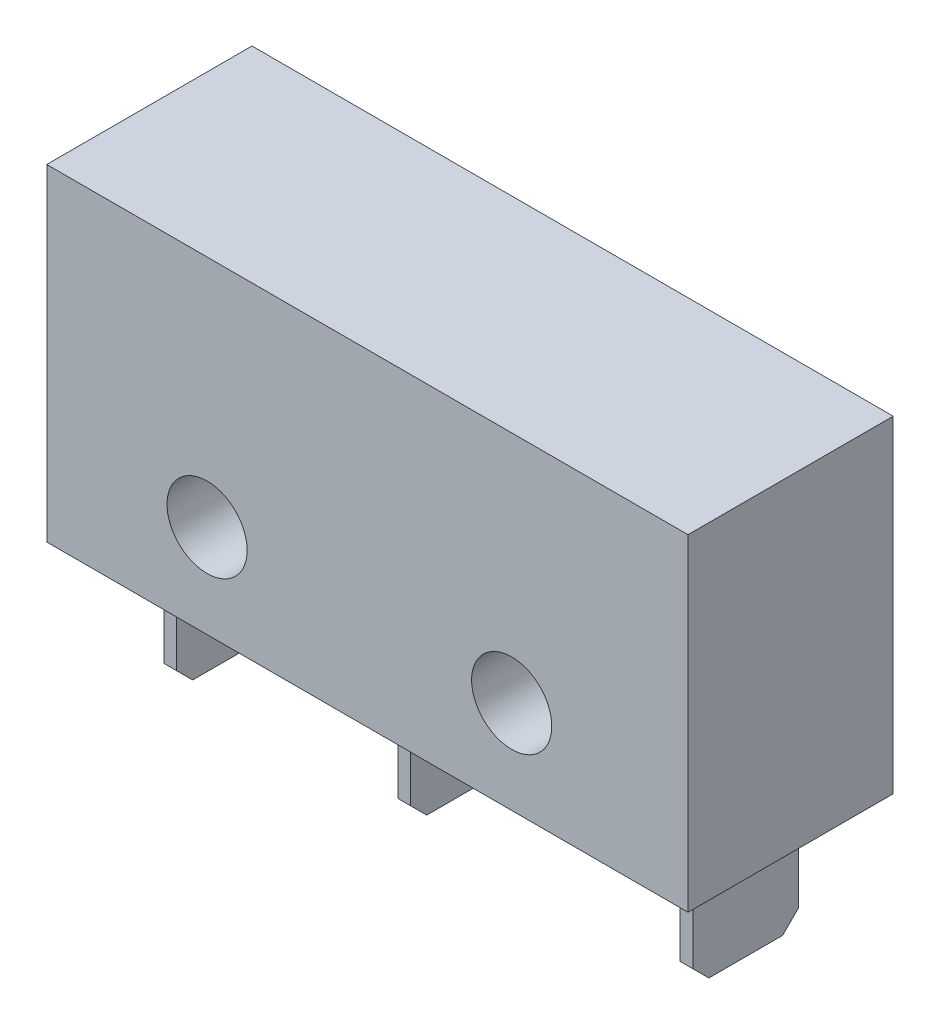
ISO-10303-21;
HEADER;
FILE_DESCRIPTION(('STEP AP214'),'2;1');
FILE_NAME('part.step','',(''),(''),'','','');
FILE_SCHEMA(('AUTOMOTIVE_DESIGN { 1 0 10303 214 1 1 1 1 }'));
ENDSEC;
DATA;
#1=APPLICATION_CONTEXT('core data for automotive mechanical design processes');
#2=APPLICATION_PROTOCOL_DEFINITION('international standard','automotive_design',2000,#1);
#3=PRODUCT_CONTEXT('',#1,'mechanical');
#4=PRODUCT('Part','Part','',(#3));
#5=PRODUCT_RELATED_PRODUCT_CATEGORY('part','',(#4));
#6=PRODUCT_DEFINITION_FORMATION('','',#4);
#7=PRODUCT_DEFINITION_CONTEXT('part definition',#1,'design');
#8=PRODUCT_DEFINITION('design','',#6,#7);
#9=PRODUCT_DEFINITION_SHAPE('','',#8);
#10=(LENGTH_UNIT() NAMED_UNIT(*) SI_UNIT(.MILLI.,.METRE.));
#11=(NAMED_UNIT(*) PLANE_ANGLE_UNIT() SI_UNIT($,.RADIAN.));
#12=(NAMED_UNIT(*) SI_UNIT($,.STERADIAN.) SOLID_ANGLE_UNIT());
#13=UNCERTAINTY_MEASURE_WITH_UNIT(LENGTH_MEASURE(1.E-05),#10,'distance_accuracy_value','');
#14=(GEOMETRIC_REPRESENTATION_CONTEXT(3) GLOBAL_UNCERTAINTY_ASSIGNED_CONTEXT((#13)) GLOBAL_UNIT_ASSIGNED_CONTEXT((#10,
#11,#12)) REPRESENTATION_CONTEXT('',''));
#15=CARTESIAN_POINT('',(0.,0.,0.));
#16=DIRECTION('',(0.,0.,1.));
#17=DIRECTION('',(1.,0.,0.));
#18=AXIS2_PLACEMENT_3D('',#15,#16,#17);
#19=CARTESIAN_POINT('',(0.,0.,6.4));
#20=DIRECTION('',(0.,0.999999999999998,0.));
#21=DIRECTION('',(0.,0.,0.999999999999996));
#22=AXIS2_PLACEMENT_3D('',#19,#20,#21);
#23=PLANE('',#22);
#24=DIRECTION('',(0.,0.,-0.999999999999996));
#25=VECTOR('',#24,1.);
#26=CARTESIAN_POINT('',(9.4,0.,4.85));
#27=LINE('',#26,#25);
#28=CARTESIAN_POINT('',(9.4,0.,4.85));
#29=VERTEX_POINT('',#28);
#30=CARTESIAN_POINT('',(9.4,0.,1.55));
#31=VERTEX_POINT('',#30);
#32=EDGE_CURVE('E218',#29,#31,#27,.T.);
#33=ORIENTED_EDGE('',*,*,#32,.F.);
#34=DIRECTION('',(-0.999999999999998,0.,0.));
#35=VECTOR('',#34,1.);
#36=CARTESIAN_POINT('',(9.4,0.,4.85));
#37=LINE('',#36,#35);
#38=CARTESIAN_POINT('',(9.8,-1.2490009027033E-13,4.85));
#39=VERTEX_POINT('',#38);
#40=EDGE_CURVE('E223',#39,#29,#37,.T.);
#41=ORIENTED_EDGE('',*,*,#40,.F.);
#42=DIRECTION('',(0.,0.,0.999999999999996));
#43=VECTOR('',#42,1.);
#44=CARTESIAN_POINT('',(9.8,-1.2490009027033E-13,4.85));
#45=LINE('',#44,#43);
#46=CARTESIAN_POINT('',(9.8,-1.2490009027033E-13,1.55));
#47=VERTEX_POINT('',#46);
#48=EDGE_CURVE('E232',#47,#39,#45,.T.);
#49=ORIENTED_EDGE('',*,*,#48,.F.);
#50=DIRECTION('',(0.999999999999998,0.,0.));
#51=VECTOR('',#50,1.);
#52=CARTESIAN_POINT('',(9.4,0.,1.55));
#53=LINE('',#52,#51);
#54=EDGE_CURVE('E229',#31,#47,#53,.T.);
#55=ORIENTED_EDGE('',*,*,#54,.F.);
#56=EDGE_LOOP('',(#33,#41,#49,#55));
#57=FACE_BOUND('',#56,.T.);
#58=DIRECTION('',(0.999999999999998,0.,0.));
#59=VECTOR('',#58,1.);
#60=CARTESIAN_POINT('',(0.,0.,0.));
#61=LINE('',#60,#59);
#62=CARTESIAN_POINT('',(0.,0.,0.));
#63=VERTEX_POINT('',#62);
#64=CARTESIAN_POINT('',(19.9999999999999,1.2490009027033E-13,0.));
#65=VERTEX_POINT('',#64);
#66=EDGE_CURVE('E284',#63,#65,#61,.T.);
#67=ORIENTED_EDGE('',*,*,#66,.T.);
#68=DIRECTION('',(0.,0.,-0.999999999999996));
#69=VECTOR('',#68,1.);
#70=CARTESIAN_POINT('',(19.9999999999999,1.2490009027033E-13,6.4));
#71=LINE('',#70,#69);
#72=CARTESIAN_POINT('',(19.9999999999999,1.2490009027033E-13,6.4));
#73=VERTEX_POINT('',#72);
#74=EDGE_CURVE('E294',#73,#65,#71,.T.);
#75=ORIENTED_EDGE('',*,*,#74,.F.);
#76=DIRECTION('',(0.999999999999998,0.,0.));
#77=VECTOR('',#76,1.);
#78=CARTESIAN_POINT('',(0.,0.,6.4));
#79=LINE('',#78,#77);
#80=CARTESIAN_POINT('',(0.,0.,6.4));
#81=VERTEX_POINT('',#80);
#82=EDGE_CURVE('E274',#81,#73,#79,.T.);
#83=ORIENTED_EDGE('',*,*,#82,.F.);
#84=DIRECTION('',(0.,0.,-0.999999999999996));
#85=VECTOR('',#84,1.);
#86=CARTESIAN_POINT('',(0.,0.,6.4));
#87=LINE('',#86,#85);
#88=EDGE_CURVE('E297',#81,#63,#87,.T.);
#89=ORIENTED_EDGE('',*,*,#88,.T.);
#90=EDGE_LOOP('',(#67,#75,#83,#89));
#91=FACE_BOUND('',#90,.T.);
#92=DIRECTION('',(0.,0.,-0.999999999999996));
#93=VECTOR('',#92,1.);
#94=CARTESIAN_POINT('',(18.1999999999999,3.7470027081099E-13,4.85));
#95=LINE('',#94,#93);
#96=CARTESIAN_POINT('',(18.1999999999999,3.7470027081099E-13,4.85));
#97=VERTEX_POINT('',#96);
#98=CARTESIAN_POINT('',(18.1999999999999,3.7470027081099E-13,1.55));
#99=VERTEX_POINT('',#98);
#100=EDGE_CURVE('E244',#97,#99,#95,.T.);
#101=ORIENTED_EDGE('',*,*,#100,.F.);
#102=DIRECTION('',(-0.999999999999998,0.,0.));
#103=VECTOR('',#102,1.);
#104=CARTESIAN_POINT('',(18.1999999999999,3.7470027081099E-13,4.85));
#105=LINE('',#104,#103);
#106=CARTESIAN_POINT('',(18.5999999999999,1.2490009027033E-13,4.84999999999999));
#107=VERTEX_POINT('',#106);
#108=EDGE_CURVE('E249',#107,#97,#105,.T.);
#109=ORIENTED_EDGE('',*,*,#108,.F.);
#110=DIRECTION('',(0.,0.,0.999999999999996));
#111=VECTOR('',#110,1.);
#112=CARTESIAN_POINT('',(18.5999999999999,1.2490009027033E-13,4.84999999999999));
#113=LINE('',#112,#111);
#114=CARTESIAN_POINT('',(18.5999999999999,1.2490009027033E-13,1.55));
#115=VERTEX_POINT('',#114);
#116=EDGE_CURVE('E258',#115,#107,#113,.T.);
#117=ORIENTED_EDGE('',*,*,#116,.F.);
#118=DIRECTION('',(0.999999999999998,0.,0.));
#119=VECTOR('',#118,1.);
#120=CARTESIAN_POINT('',(18.1999999999999,3.7470027081099E-13,1.55));
#121=LINE('',#120,#119);
#122=EDGE_CURVE('E255',#99,#115,#121,.T.);
#123=ORIENTED_EDGE('',*,*,#122,.F.);
#124=EDGE_LOOP('',(#101,#109,#117,#123));
#125=FACE_BOUND('',#124,.T.);
#126=DIRECTION('',(0.,0.,-0.999999999999996));
#127=VECTOR('',#126,1.);
#128=CARTESIAN_POINT('',(2.1,0.,4.85));
#129=LINE('',#128,#127);
#130=CARTESIAN_POINT('',(2.1,0.,4.85));
#131=VERTEX_POINT('',#130);
#132=CARTESIAN_POINT('',(2.1,0.,1.55));
#133=VERTEX_POINT('',#132);
#134=EDGE_CURVE('E186',#131,#133,#129,.T.);
#135=ORIENTED_EDGE('',*,*,#134,.F.);
#136=DIRECTION('',(-0.999999999999998,0.,0.));
#137=VECTOR('',#136,1.);
#138=CARTESIAN_POINT('',(2.1,0.,4.85));
#139=LINE('',#138,#137);
#140=CARTESIAN_POINT('',(2.5,0.,4.85));
#141=VERTEX_POINT('',#140);
#142=EDGE_CURVE('E197',#141,#131,#139,.T.);
#143=ORIENTED_EDGE('',*,*,#142,.F.);
#144=DIRECTION('',(0.,0.,0.999999999999996));
#145=VECTOR('',#144,1.);
#146=CARTESIAN_POINT('',(2.5,0.,4.85));
#147=LINE('',#146,#145);
#148=CARTESIAN_POINT('',(2.5,0.,1.55));
#149=VERTEX_POINT('',#148);
#150=EDGE_CURVE('E206',#149,#141,#147,.T.);
#151=ORIENTED_EDGE('',*,*,#150,.F.);
#152=DIRECTION('',(0.999999999999998,0.,0.));
#153=VECTOR('',#152,1.);
#154=CARTESIAN_POINT('',(2.1,0.,1.55));
#155=LINE('',#154,#153);
#156=EDGE_CURVE('E200',#133,#149,#155,.T.);
#157=ORIENTED_EDGE('',*,*,#156,.F.);
#158=EDGE_LOOP('',(#135,#143,#151,#157));
#159=FACE_BOUND('',#158,.T.);
#160=ADVANCED_FACE('F36',(#57,#91,#125,#159),#23,.F.);
#161=CARTESIAN_POINT('',(0.,0.,6.4));
#162=DIRECTION('',(0.999999999999998,0.,0.));
#163=DIRECTION('',(0.,0.,-0.999999999999996));
#164=AXIS2_PLACEMENT_3D('',#161,#162,#163);
#165=PLANE('',#164);
#166=DIRECTION('',(0.,-0.999999999999998,0.));
#167=VECTOR('',#166,1.);
#168=CARTESIAN_POINT('',(0.,0.,0.));
#169=LINE('',#168,#167);
#170=CARTESIAN_POINT('',(0.,10.2,0.));
#171=VERTEX_POINT('',#170);
#172=EDGE_CURVE('E270',#171,#63,#169,.T.);
#173=ORIENTED_EDGE('',*,*,#172,.T.);
#174=ORIENTED_EDGE('',*,*,#88,.F.);
#175=DIRECTION('',(0.,-0.999999999999998,0.));
#176=VECTOR('',#175,1.);
#177=CARTESIAN_POINT('',(0.,0.,6.4));
#178=LINE('',#177,#176);
#179=CARTESIAN_POINT('',(0.,10.2,6.4));
#180=VERTEX_POINT('',#179);
#181=EDGE_CURVE('E271',#180,#81,#178,.T.);
#182=ORIENTED_EDGE('',*,*,#181,.F.);
#183=DIRECTION('',(0.,0.,-0.999999999999996));
#184=VECTOR('',#183,1.);
#185=CARTESIAN_POINT('',(0.,10.2,6.4));
#186=LINE('',#185,#184);
#187=EDGE_CURVE('E281',#180,#171,#186,.T.);
#188=ORIENTED_EDGE('',*,*,#187,.T.);
#189=EDGE_LOOP('',(#173,#174,#182,#188));
#190=FACE_BOUND('',#189,.T.);
#191=ADVANCED_FACE('F389',(#190),#165,.F.);
#192=CARTESIAN_POINT('',(19.9999999999999,1.2490009027033E-13,6.4));
#193=DIRECTION('',(-0.999999999999998,0.,0.));
#194=DIRECTION('',(0.,0.,0.999999999999996));
#195=AXIS2_PLACEMENT_3D('',#192,#193,#194);
#196=PLANE('',#195);
#197=DIRECTION('',(0.,0.999999999999998,0.));
#198=VECTOR('',#197,1.);
#199=CARTESIAN_POINT('',(19.9999999999999,1.2490009027033E-13,0.));
#200=LINE('',#199,#198);
#201=CARTESIAN_POINT('',(19.9999999999999,10.2,0.));
#202=VERTEX_POINT('',#201);
#203=EDGE_CURVE('E286',#65,#202,#200,.T.);
#204=ORIENTED_EDGE('',*,*,#203,.T.);
#205=DIRECTION('',(0.,0.,-0.999999999999996));
#206=VECTOR('',#205,1.);
#207=CARTESIAN_POINT('',(19.9999999999999,10.2,6.4));
#208=LINE('',#207,#206);
#209=CARTESIAN_POINT('',(19.9999999999999,10.2,6.4));
#210=VERTEX_POINT('',#209);
#211=EDGE_CURVE('E291',#210,#202,#208,.T.);
#212=ORIENTED_EDGE('',*,*,#211,.F.);
#213=DIRECTION('',(0.,0.999999999999998,0.));
#214=VECTOR('',#213,1.);
#215=CARTESIAN_POINT('',(19.9999999999999,1.2490009027033E-13,6.4));
#216=LINE('',#215,#214);
#217=EDGE_CURVE('E277',#73,#210,#216,.T.);
#218=ORIENTED_EDGE('',*,*,#217,.F.);
#219=ORIENTED_EDGE('',*,*,#74,.T.);
#220=EDGE_LOOP('',(#204,#212,#218,#219));
#221=FACE_BOUND('',#220,.T.);
#222=ADVANCED_FACE('F397',(#221),#196,.F.);
#223=CARTESIAN_POINT('',(0.,10.2,6.4));
#224=DIRECTION('',(0.,-0.999999999999998,0.));
#225=DIRECTION('',(0.,0.,-0.999999999999996));
#226=AXIS2_PLACEMENT_3D('',#223,#224,#225);
#227=PLANE('',#226);
#228=DIRECTION('',(-0.999999999999998,0.,0.));
#229=VECTOR('',#228,1.);
#230=CARTESIAN_POINT('',(0.,10.2,0.));
#231=LINE('',#230,#229);
#232=EDGE_CURVE('E275',#202,#171,#231,.T.);
#233=ORIENTED_EDGE('',*,*,#232,.T.);
#234=ORIENTED_EDGE('',*,*,#187,.F.);
#235=DIRECTION('',(-0.999999999999998,0.,0.));
#236=VECTOR('',#235,1.);
#237=CARTESIAN_POINT('',(0.,10.2,6.4));
#238=LINE('',#237,#236);
#239=EDGE_CURVE('E279',#210,#180,#238,.T.);
#240=ORIENTED_EDGE('',*,*,#239,.F.);
#241=ORIENTED_EDGE('',*,*,#211,.T.);
#242=EDGE_LOOP('',(#233,#234,#240,#241));
#243=FACE_BOUND('',#242,.T.);
#244=ADVANCED_FACE('F379',(#243),#227,.F.);
#245=CARTESIAN_POINT('',(0.,0.,6.4));
#246=DIRECTION('',(0.,0.,-0.999999999999996));
#247=DIRECTION('',(-0.999999999999998,0.,0.));
#248=AXIS2_PLACEMENT_3D('',#245,#246,#247);
#249=PLANE('',#248);
#250=CARTESIAN_POINT('',(14.5,2.90000000000011,6.4));
#251=DIRECTION('',(0.,0.,0.999999999999996));
#252=DIRECTION('',(0.999999999999998,0.,0.));
#253=AXIS2_PLACEMENT_3D('',#250,#251,#252);
#254=CIRCLE('',#253,1.25);
#255=CARTESIAN_POINT('',(15.75,2.90000000000011,6.4));
#256=VERTEX_POINT('',#255);
#257=EDGE_CURVE('E201',#256,#256,#254,.T.);
#258=ORIENTED_EDGE('',*,*,#257,.F.);
#259=EDGE_LOOP('',(#258));
#260=FACE_BOUND('',#259,.T.);
#261=CARTESIAN_POINT('',(4.99999999999994,2.90000000000037,6.4));
#262=DIRECTION('',(0.,0.,0.999999999999996));
#263=DIRECTION('',(0.999999999999998,0.,0.));
#264=AXIS2_PLACEMENT_3D('',#261,#262,#263);
#265=CIRCLE('',#264,1.25);
#266=CARTESIAN_POINT('',(6.24999999999994,2.90000000000037,6.4));
#267=VERTEX_POINT('',#266);
#268=EDGE_CURVE('E364',#267,#267,#265,.T.);
#269=ORIENTED_EDGE('',*,*,#268,.F.);
#270=EDGE_LOOP('',(#269));
#271=FACE_BOUND('',#270,.T.);
#272=ORIENTED_EDGE('',*,*,#181,.T.);
#273=ORIENTED_EDGE('',*,*,#82,.T.);
#274=ORIENTED_EDGE('',*,*,#217,.T.);
#275=ORIENTED_EDGE('',*,*,#239,.T.);
#276=EDGE_LOOP('',(#272,#273,#274,#275));
#277=FACE_BOUND('',#276,.T.);
#278=ADVANCED_FACE('F375',(#260,#271,#277),#249,.F.);
#279=CARTESIAN_POINT('',(0.,0.,0.));
#280=DIRECTION('',(0.,0.,-0.999999999999996));
#281=DIRECTION('',(-0.999999999999998,0.,0.));
#282=AXIS2_PLACEMENT_3D('',#279,#280,#281);
#283=PLANE('',#282);
#284=CARTESIAN_POINT('',(14.4999999999999,2.90000000000011,0.));
#285=DIRECTION('',(0.,0.,-0.999999999999996));
#286=DIRECTION('',(-0.999999999999998,0.,0.));
#287=AXIS2_PLACEMENT_3D('',#284,#285,#286);
#288=CIRCLE('',#287,1.25);
#289=CARTESIAN_POINT('',(13.2499999999999,2.90000000000011,0.));
#290=VERTEX_POINT('',#289);
#291=EDGE_CURVE('E367',#290,#290,#288,.F.);
#292=ORIENTED_EDGE('',*,*,#291,.T.);
#293=EDGE_LOOP('',(#292));
#294=FACE_BOUND('',#293,.T.);
#295=CARTESIAN_POINT('',(4.99999999999994,2.90000000000037,0.));
#296=DIRECTION('',(0.,0.,-0.999999999999996));
#297=DIRECTION('',(-0.999999999999998,0.,0.));
#298=AXIS2_PLACEMENT_3D('',#295,#296,#297);
#299=CIRCLE('',#298,1.25);
#300=CARTESIAN_POINT('',(3.74999999999995,2.90000000000037,0.));
#301=VERTEX_POINT('',#300);
#302=EDGE_CURVE('E361',#301,#301,#299,.F.);
#303=ORIENTED_EDGE('',*,*,#302,.T.);
#304=EDGE_LOOP('',(#303));
#305=FACE_BOUND('',#304,.T.);
#306=ORIENTED_EDGE('',*,*,#172,.F.);
#307=ORIENTED_EDGE('',*,*,#232,.F.);
#308=ORIENTED_EDGE('',*,*,#203,.F.);
#309=ORIENTED_EDGE('',*,*,#66,.F.);
#310=EDGE_LOOP('',(#306,#307,#308,#309));
#311=FACE_BOUND('',#310,.T.);
#312=ADVANCED_FACE('F378',(#294,#305,#311),#283,.T.);
#313=CARTESIAN_POINT('',(18.2,-3.49999999999963,4.85));
#314=DIRECTION('',(0.999999999999998,0.,0.));
#315=DIRECTION('',(0.,0.,-0.999999999999996));
#316=AXIS2_PLACEMENT_3D('',#313,#314,#315);
#317=PLANE('',#316);
#318=DIRECTION('',(0.,0.,-0.999999999999996));
#319=VECTOR('',#318,1.);
#320=CARTESIAN_POINT('',(18.2,-3.49999999999963,4.85));
#321=LINE('',#320,#319);
#322=CARTESIAN_POINT('',(18.2,-3.49999999999963,4.35));
#323=VERTEX_POINT('',#322);
#324=CARTESIAN_POINT('',(18.2,-3.49999999999963,2.05));
#325=VERTEX_POINT('',#324);
#326=EDGE_CURVE('E245',#323,#325,#321,.T.);
#327=ORIENTED_EDGE('',*,*,#326,.F.);
#328=DIRECTION('',(0.,0.707106781186545,0.707106781186545));
#329=VECTOR('',#328,1.);
#330=CARTESIAN_POINT('',(18.2,-3.49999999999963,4.35));
#331=LINE('',#330,#329);
#332=CARTESIAN_POINT('',(18.1999999999999,-2.99999999999963,4.85));
#333=VERTEX_POINT('',#332);
#334=EDGE_CURVE('E308',#323,#333,#331,.T.);
#335=ORIENTED_EDGE('',*,*,#334,.T.);
#336=DIRECTION('',(0.,0.999999999999998,0.));
#337=VECTOR('',#336,1.);
#338=CARTESIAN_POINT('',(18.2,-3.49999999999963,4.85));
#339=LINE('',#338,#337);
#340=EDGE_CURVE('E252',#333,#97,#339,.T.);
#341=ORIENTED_EDGE('',*,*,#340,.T.);
#342=ORIENTED_EDGE('',*,*,#100,.T.);
#343=DIRECTION('',(0.,0.999999999999998,0.));
#344=VECTOR('',#343,1.);
#345=CARTESIAN_POINT('',(18.2,-3.49999999999963,1.55));
#346=LINE('',#345,#344);
#347=CARTESIAN_POINT('',(18.1999999999999,-2.99999999999963,1.55));
#348=VERTEX_POINT('',#347);
#349=EDGE_CURVE('E268',#348,#99,#346,.T.);
#350=ORIENTED_EDGE('',*,*,#349,.F.);
#351=DIRECTION('',(0.,-0.707106781186545,0.707106781186545));
#352=VECTOR('',#351,1.);
#353=CARTESIAN_POINT('',(18.2,-3.49999999999963,2.05));
#354=LINE('',#353,#352);
#355=EDGE_CURVE('E306',#348,#325,#354,.T.);
#356=ORIENTED_EDGE('',*,*,#355,.T.);
#357=EDGE_LOOP('',(#327,#335,#341,#342,#350,#356));
#358=FACE_BOUND('',#357,.T.);
#359=ADVANCED_FACE('F402',(#358),#317,.F.);
#360=CARTESIAN_POINT('',(18.2,-3.49999999999963,1.55));
#361=DIRECTION('',(0.,0.,0.999999999999996));
#362=DIRECTION('',(0.999999999999998,0.,0.));
#363=AXIS2_PLACEMENT_3D('',#360,#361,#362);
#364=PLANE('',#363);
#365=DIRECTION('',(0.,0.999999999999998,0.));
#366=VECTOR('',#365,1.);
#367=CARTESIAN_POINT('',(18.6,-3.49999999999988,1.55));
#368=LINE('',#367,#366);
#369=CARTESIAN_POINT('',(18.5999999999999,-2.99999999999988,1.55));
#370=VERTEX_POINT('',#369);
#371=EDGE_CURVE('E266',#370,#115,#368,.T.);
#372=ORIENTED_EDGE('',*,*,#371,.F.);
#373=DIRECTION('',(-0.999999999999998,0.,0.));
#374=VECTOR('',#373,1.);
#375=CARTESIAN_POINT('',(18.1999999999999,-2.99999999999963,1.55));
#376=LINE('',#375,#374);
#377=EDGE_CURVE('E316',#370,#348,#376,.T.);
#378=ORIENTED_EDGE('',*,*,#377,.T.);
#379=ORIENTED_EDGE('',*,*,#349,.T.);
#380=ORIENTED_EDGE('',*,*,#122,.T.);
#381=EDGE_LOOP('',(#372,#378,#379,#380));
#382=FACE_BOUND('',#381,.T.);
#383=ADVANCED_FACE('F408',(#382),#364,.F.);
#384=CARTESIAN_POINT('',(18.6,-3.49999999999988,4.84999999999999));
#385=DIRECTION('',(-0.999999999999998,0.,0.));
#386=DIRECTION('',(0.,0.,0.999999999999996));
#387=AXIS2_PLACEMENT_3D('',#384,#385,#386);
#388=PLANE('',#387);
#389=DIRECTION('',(0.,0.999999999999998,0.));
#390=VECTOR('',#389,1.);
#391=CARTESIAN_POINT('',(18.6,-3.49999999999988,4.84999999999999));
#392=LINE('',#391,#390);
#393=CARTESIAN_POINT('',(18.5999999999999,-2.99999999999988,4.84999999999999));
#394=VERTEX_POINT('',#393);
#395=EDGE_CURVE('E264',#394,#107,#392,.T.);
#396=ORIENTED_EDGE('',*,*,#395,.F.);
#397=DIRECTION('',(0.,-0.707106781186545,-0.707106781186545));
#398=VECTOR('',#397,1.);
#399=CARTESIAN_POINT('',(18.6,-3.49999999999989,4.34999999999998));
#400=LINE('',#399,#398);
#401=CARTESIAN_POINT('',(18.6,-3.49999999999988,4.34999999999999));
#402=VERTEX_POINT('',#401);
#403=EDGE_CURVE('E314',#394,#402,#400,.T.);
#404=ORIENTED_EDGE('',*,*,#403,.T.);
#405=DIRECTION('',(0.,0.,0.999999999999996));
#406=VECTOR('',#405,1.);
#407=CARTESIAN_POINT('',(18.6,-3.49999999999988,4.84999999999999));
#408=LINE('',#407,#406);
#409=CARTESIAN_POINT('',(18.6,-3.49999999999988,2.05));
#410=VERTEX_POINT('',#409);
#411=EDGE_CURVE('E248',#410,#402,#408,.T.);
#412=ORIENTED_EDGE('',*,*,#411,.F.);
#413=DIRECTION('',(0.,0.707106781186545,-0.707106781186545));
#414=VECTOR('',#413,1.);
#415=CARTESIAN_POINT('',(18.6,-3.49999999999986,2.04999999999999));
#416=LINE('',#415,#414);
#417=EDGE_CURVE('E312',#410,#370,#416,.T.);
#418=ORIENTED_EDGE('',*,*,#417,.T.);
#419=ORIENTED_EDGE('',*,*,#371,.T.);
#420=ORIENTED_EDGE('',*,*,#116,.T.);
#421=EDGE_LOOP('',(#396,#404,#412,#418,#419,#420));
#422=FACE_BOUND('',#421,.T.);
#423=ADVANCED_FACE('F569',(#422),#388,.F.);
#424=CARTESIAN_POINT('',(18.2,-3.49999999999963,4.85));
#425=DIRECTION('',(0.,0.,-0.999999999999996));
#426=DIRECTION('',(-0.999999999999998,0.,0.));
#427=AXIS2_PLACEMENT_3D('',#424,#425,#426);
#428=PLANE('',#427);
#429=ORIENTED_EDGE('',*,*,#340,.F.);
#430=DIRECTION('',(0.999999999999998,0.,0.));
#431=VECTOR('',#430,1.);
#432=CARTESIAN_POINT('',(18.5999999999999,-2.99999999999988,4.84999999999999));
#433=LINE('',#432,#431);
#434=EDGE_CURVE('E310',#333,#394,#433,.T.);
#435=ORIENTED_EDGE('',*,*,#434,.T.);
#436=ORIENTED_EDGE('',*,*,#395,.T.);
#437=ORIENTED_EDGE('',*,*,#108,.T.);
#438=EDGE_LOOP('',(#429,#435,#436,#437));
#439=FACE_BOUND('',#438,.T.);
#440=ADVANCED_FACE('F564',(#439),#428,.F.);
#441=CARTESIAN_POINT('',(0.,-3.5,0.));
#442=DIRECTION('',(0.,-0.999999999999998,0.));
#443=DIRECTION('',(0.,0.,-0.999999999999996));
#444=AXIS2_PLACEMENT_3D('',#441,#442,#443);
#445=PLANE('',#444);
#446=ORIENTED_EDGE('',*,*,#411,.T.);
#447=DIRECTION('',(-0.999999999999998,0.,0.));
#448=VECTOR('',#447,1.);
#449=CARTESIAN_POINT('',(18.2,-3.49999999999963,4.35));
#450=LINE('',#449,#448);
#451=EDGE_CURVE('E303',#402,#323,#450,.T.);
#452=ORIENTED_EDGE('',*,*,#451,.T.);
#453=ORIENTED_EDGE('',*,*,#326,.T.);
#454=DIRECTION('',(0.999999999999998,0.,0.));
#455=VECTOR('',#454,1.);
#456=CARTESIAN_POINT('',(18.6,-3.49999999999988,2.05));
#457=LINE('',#456,#455);
#458=EDGE_CURVE('E300',#325,#410,#457,.T.);
#459=ORIENTED_EDGE('',*,*,#458,.T.);
#460=EDGE_LOOP('',(#446,#452,#453,#459));
#461=FACE_BOUND('',#460,.T.);
#462=ADVANCED_FACE('F547',(#461),#445,.T.);
#463=CARTESIAN_POINT('',(9.4,-3.5,4.85));
#464=DIRECTION('',(0.999999999999998,0.,0.));
#465=DIRECTION('',(0.,0.,-0.999999999999996));
#466=AXIS2_PLACEMENT_3D('',#463,#464,#465);
#467=PLANE('',#466);
#468=DIRECTION('',(0.,0.,-0.999999999999996));
#469=VECTOR('',#468,1.);
#470=CARTESIAN_POINT('',(9.4,-3.5,4.85));
#471=LINE('',#470,#469);
#472=CARTESIAN_POINT('',(9.4,-3.5,4.35000000000001));
#473=VERTEX_POINT('',#472);
#474=CARTESIAN_POINT('',(9.4,-3.5,2.05));
#475=VERTEX_POINT('',#474);
#476=EDGE_CURVE('E219',#473,#475,#471,.T.);
#477=ORIENTED_EDGE('',*,*,#476,.F.);
#478=DIRECTION('',(0.,0.707106781186548,0.707106781186543));
#479=VECTOR('',#478,1.);
#480=CARTESIAN_POINT('',(9.4,-3.5,4.35000000000001));
#481=LINE('',#480,#479);
#482=CARTESIAN_POINT('',(9.40000000000002,-3.,4.85));
#483=VERTEX_POINT('',#482);
#484=EDGE_CURVE('E326',#473,#483,#481,.T.);
#485=ORIENTED_EDGE('',*,*,#484,.T.);
#486=DIRECTION('',(0.,0.999999999999998,0.));
#487=VECTOR('',#486,1.);
#488=CARTESIAN_POINT('',(9.4,-3.5,4.85));
#489=LINE('',#488,#487);
#490=EDGE_CURVE('E226',#483,#29,#489,.T.);
#491=ORIENTED_EDGE('',*,*,#490,.T.);
#492=ORIENTED_EDGE('',*,*,#32,.T.);
#493=DIRECTION('',(0.,0.999999999999998,0.));
#494=VECTOR('',#493,1.);
#495=CARTESIAN_POINT('',(9.4,-3.5,1.55));
#496=LINE('',#495,#494);
#497=CARTESIAN_POINT('',(9.4,-3.,1.55));
#498=VERTEX_POINT('',#497);
#499=EDGE_CURVE('E242',#498,#31,#496,.T.);
#500=ORIENTED_EDGE('',*,*,#499,.F.);
#501=DIRECTION('',(0.,-0.707106781186546,0.707106781186546));
#502=VECTOR('',#501,1.);
#503=CARTESIAN_POINT('',(9.4,-3.5,2.05));
#504=LINE('',#503,#502);
#505=EDGE_CURVE('E324',#498,#475,#504,.T.);
#506=ORIENTED_EDGE('',*,*,#505,.T.);
#507=EDGE_LOOP('',(#477,#485,#491,#492,#500,#506));
#508=FACE_BOUND('',#507,.T.);
#509=ADVANCED_FACE('F508',(#508),#467,.F.);
#510=CARTESIAN_POINT('',(9.4,-3.5,1.55));
#511=DIRECTION('',(0.,0.,0.999999999999996));
#512=DIRECTION('',(0.999999999999998,0.,0.));
#513=AXIS2_PLACEMENT_3D('',#510,#511,#512);
#514=PLANE('',#513);
#515=DIRECTION('',(0.,0.999999999999998,0.));
#516=VECTOR('',#515,1.);
#517=CARTESIAN_POINT('',(9.79999999999999,-3.49999999999999,1.55));
#518=LINE('',#517,#516);
#519=CARTESIAN_POINT('',(9.79999999999999,-2.99999999999999,1.55));
#520=VERTEX_POINT('',#519);
#521=EDGE_CURVE('E240',#520,#47,#518,.T.);
#522=ORIENTED_EDGE('',*,*,#521,.F.);
#523=DIRECTION('',(-0.999999999999998,0.,0.));
#524=VECTOR('',#523,1.);
#525=CARTESIAN_POINT('',(9.4,-3.,1.55));
#526=LINE('',#525,#524);
#527=EDGE_CURVE('E334',#520,#498,#526,.T.);
#528=ORIENTED_EDGE('',*,*,#527,.T.);
#529=ORIENTED_EDGE('',*,*,#499,.T.);
#530=ORIENTED_EDGE('',*,*,#54,.T.);
#531=EDGE_LOOP('',(#522,#528,#529,#530));
#532=FACE_BOUND('',#531,.T.);
#533=ADVANCED_FACE('F496',(#532),#514,.F.);
#534=CARTESIAN_POINT('',(9.79999999999999,-3.49999999999999,4.85));
#535=DIRECTION('',(-0.999999999999998,0.,0.));
#536=DIRECTION('',(0.,0.,0.999999999999996));
#537=AXIS2_PLACEMENT_3D('',#534,#535,#536);
#538=PLANE('',#537);
#539=DIRECTION('',(0.,0.999999999999998,0.));
#540=VECTOR('',#539,1.);
#541=CARTESIAN_POINT('',(9.79999999999999,-3.49999999999999,4.85));
#542=LINE('',#541,#540);
#543=CARTESIAN_POINT('',(9.80000000000001,-2.99999999999999,4.85));
#544=VERTEX_POINT('',#543);
#545=EDGE_CURVE('E238',#544,#39,#542,.T.);
#546=ORIENTED_EDGE('',*,*,#545,.F.);
#547=DIRECTION('',(0.,-0.707106781186548,-0.707106781186543));
#548=VECTOR('',#547,1.);
#549=CARTESIAN_POINT('',(9.79999999999999,-3.49999999999999,4.35000000000001));
#550=LINE('',#549,#548);
#551=CARTESIAN_POINT('',(9.79999999999999,-3.49999999999999,4.35000000000001));
#552=VERTEX_POINT('',#551);
#553=EDGE_CURVE('E332',#544,#552,#550,.T.);
#554=ORIENTED_EDGE('',*,*,#553,.T.);
#555=DIRECTION('',(0.,0.,0.999999999999996));
#556=VECTOR('',#555,1.);
#557=CARTESIAN_POINT('',(9.79999999999999,-3.49999999999999,4.85));
#558=LINE('',#557,#556);
#559=CARTESIAN_POINT('',(9.79999999999999,-3.49999999999999,2.05));
#560=VERTEX_POINT('',#559);
#561=EDGE_CURVE('E222',#560,#552,#558,.T.);
#562=ORIENTED_EDGE('',*,*,#561,.F.);
#563=DIRECTION('',(0.,0.707106781186546,-0.707106781186546));
#564=VECTOR('',#563,1.);
#565=CARTESIAN_POINT('',(9.79999999999999,-3.49999999999999,2.05));
#566=LINE('',#565,#564);
#567=EDGE_CURVE('E330',#560,#520,#566,.T.);
#568=ORIENTED_EDGE('',*,*,#567,.T.);
#569=ORIENTED_EDGE('',*,*,#521,.T.);
#570=ORIENTED_EDGE('',*,*,#48,.T.);
#571=EDGE_LOOP('',(#546,#554,#562,#568,#569,#570));
#572=FACE_BOUND('',#571,.T.);
#573=ADVANCED_FACE('F490',(#572),#538,.F.);
#574=CARTESIAN_POINT('',(9.4,-3.5,4.85));
#575=DIRECTION('',(0.,0.,-0.999999999999996));
#576=DIRECTION('',(-0.999999999999998,0.,0.));
#577=AXIS2_PLACEMENT_3D('',#574,#575,#576);
#578=PLANE('',#577);
#579=ORIENTED_EDGE('',*,*,#490,.F.);
#580=DIRECTION('',(0.999999999999998,0.,0.));
#581=VECTOR('',#580,1.);
#582=CARTESIAN_POINT('',(9.80000000000001,-2.99999999999999,4.85));
#583=LINE('',#582,#581);
#584=EDGE_CURVE('E328',#483,#544,#583,.T.);
#585=ORIENTED_EDGE('',*,*,#584,.T.);
#586=ORIENTED_EDGE('',*,*,#545,.T.);
#587=ORIENTED_EDGE('',*,*,#40,.T.);
#588=EDGE_LOOP('',(#579,#585,#586,#587));
#589=FACE_BOUND('',#588,.T.);
#590=ADVANCED_FACE('F495',(#589),#578,.F.);
#591=CARTESIAN_POINT('',(0.,-3.5,0.));
#592=DIRECTION('',(0.,-0.999999999999998,0.));
#593=DIRECTION('',(0.,0.,-0.999999999999996));
#594=AXIS2_PLACEMENT_3D('',#591,#592,#593);
#595=PLANE('',#594);
#596=ORIENTED_EDGE('',*,*,#561,.T.);
#597=DIRECTION('',(-0.999999999999998,0.,0.));
#598=VECTOR('',#597,1.);
#599=CARTESIAN_POINT('',(9.4,-3.5,4.35000000000001));
#600=LINE('',#599,#598);
#601=EDGE_CURVE('E321',#552,#473,#600,.T.);
#602=ORIENTED_EDGE('',*,*,#601,.T.);
#603=ORIENTED_EDGE('',*,*,#476,.T.);
#604=DIRECTION('',(0.999999999999998,0.,0.));
#605=VECTOR('',#604,1.);
#606=CARTESIAN_POINT('',(9.79999999999999,-3.49999999999999,2.05));
#607=LINE('',#606,#605);
#608=EDGE_CURVE('E318',#475,#560,#607,.T.);
#609=ORIENTED_EDGE('',*,*,#608,.T.);
#610=EDGE_LOOP('',(#596,#602,#603,#609));
#611=FACE_BOUND('',#610,.T.);
#612=ADVANCED_FACE('F522',(#611),#595,.T.);
#613=CARTESIAN_POINT('',(2.10000000000006,-3.5,4.85));
#614=DIRECTION('',(0.999999999999998,0.,0.));
#615=DIRECTION('',(0.,0.,-0.999999999999996));
#616=AXIS2_PLACEMENT_3D('',#613,#614,#615);
#617=PLANE('',#616);
#618=DIRECTION('',(0.,0.999999999999998,0.));
#619=VECTOR('',#618,1.);
#620=CARTESIAN_POINT('',(2.10000000000006,-3.5,1.55));
#621=LINE('',#620,#619);
#622=CARTESIAN_POINT('',(2.10000000000001,-3.,1.55));
#623=VERTEX_POINT('',#622);
#624=EDGE_CURVE('E216',#623,#133,#621,.T.);
#625=ORIENTED_EDGE('',*,*,#624,.F.);
#626=DIRECTION('',(0.,-0.707106781186546,0.707106781186545));
#627=VECTOR('',#626,1.);
#628=CARTESIAN_POINT('',(2.10000000000006,-3.5,2.05));
#629=LINE('',#628,#627);
#630=CARTESIAN_POINT('',(2.10000000000006,-3.5,2.05));
#631=VERTEX_POINT('',#630);
#632=EDGE_CURVE('E44',#623,#631,#629,.T.);
#633=ORIENTED_EDGE('',*,*,#632,.T.);
#634=DIRECTION('',(0.,0.,-0.999999999999996));
#635=VECTOR('',#634,1.);
#636=CARTESIAN_POINT('',(2.10000000000006,-3.5,4.85));
#637=LINE('',#636,#635);
#638=CARTESIAN_POINT('',(2.10000000000006,-3.5,4.35));
#639=VERTEX_POINT('',#638);
#640=EDGE_CURVE('E205',#639,#631,#637,.T.);
#641=ORIENTED_EDGE('',*,*,#640,.F.);
#642=DIRECTION('',(0.,0.707106781186546,0.707106781186546));
#643=VECTOR('',#642,1.);
#644=CARTESIAN_POINT('',(2.10000000000006,-3.5,4.35));
#645=LINE('',#644,#643);
#646=CARTESIAN_POINT('',(2.10000000000006,-3.,4.85));
#647=VERTEX_POINT('',#646);
#648=EDGE_CURVE('E51',#639,#647,#645,.T.);
#649=ORIENTED_EDGE('',*,*,#648,.T.);
#650=DIRECTION('',(0.,0.999999999999998,0.));
#651=VECTOR('',#650,1.);
#652=CARTESIAN_POINT('',(2.10000000000006,-3.5,4.85));
#653=LINE('',#652,#651);
#654=EDGE_CURVE('E183',#647,#131,#653,.T.);
#655=ORIENTED_EDGE('',*,*,#654,.T.);
#656=ORIENTED_EDGE('',*,*,#134,.T.);
#657=EDGE_LOOP('',(#625,#633,#641,#649,#655,#656));
#658=FACE_BOUND('',#657,.T.);
#659=ADVANCED_FACE('F185',(#658),#617,.F.);
#660=CARTESIAN_POINT('',(2.10000000000006,-3.5,1.55));
#661=DIRECTION('',(0.,0.,0.999999999999996));
#662=DIRECTION('',(0.999999999999998,0.,0.));
#663=AXIS2_PLACEMENT_3D('',#660,#661,#662);
#664=PLANE('',#663);
#665=DIRECTION('',(0.,0.999999999999998,0.));
#666=VECTOR('',#665,1.);
#667=CARTESIAN_POINT('',(2.50000000000006,-3.50000000000003,1.55));
#668=LINE('',#667,#666);
#669=CARTESIAN_POINT('',(2.50000000000001,-3.00000000000003,1.55));
#670=VERTEX_POINT('',#669);
#671=EDGE_CURVE('E214',#670,#149,#668,.T.);
#672=ORIENTED_EDGE('',*,*,#671,.F.);
#673=DIRECTION('',(-0.999999999999998,0.,0.));
#674=VECTOR('',#673,1.);
#675=CARTESIAN_POINT('',(2.10000000000001,-3.,1.55));
#676=LINE('',#675,#674);
#677=EDGE_CURVE('E59',#670,#623,#676,.T.);
#678=ORIENTED_EDGE('',*,*,#677,.T.);
#679=ORIENTED_EDGE('',*,*,#624,.T.);
#680=ORIENTED_EDGE('',*,*,#156,.T.);
#681=EDGE_LOOP('',(#672,#678,#679,#680));
#682=FACE_BOUND('',#681,.T.);
#683=ADVANCED_FACE('F358',(#682),#664,.F.);
#684=CARTESIAN_POINT('',(2.50000000000006,-3.50000000000003,4.85));
#685=DIRECTION('',(-0.999999999999998,0.,0.));
#686=DIRECTION('',(0.,0.,0.999999999999996));
#687=AXIS2_PLACEMENT_3D('',#684,#685,#686);
#688=PLANE('',#687);
#689=DIRECTION('',(0.,0.,0.999999999999996));
#690=VECTOR('',#689,1.);
#691=CARTESIAN_POINT('',(2.50000000000006,-3.50000000000003,4.85));
#692=LINE('',#691,#690);
#693=CARTESIAN_POINT('',(2.50000000000006,-3.50000000000003,2.05));
#694=VERTEX_POINT('',#693);
#695=CARTESIAN_POINT('',(2.50000000000006,-3.50000000000003,4.35));
#696=VERTEX_POINT('',#695);
#697=EDGE_CURVE('E191',#694,#696,#692,.T.);
#698=ORIENTED_EDGE('',*,*,#697,.F.);
#699=DIRECTION('',(0.,0.707106781186546,-0.707106781186545));
#700=VECTOR('',#699,1.);
#701=CARTESIAN_POINT('',(2.50000000000006,-3.50000000000003,2.05));
#702=LINE('',#701,#700);
#703=EDGE_CURVE('E344',#694,#670,#702,.T.);
#704=ORIENTED_EDGE('',*,*,#703,.T.);
#705=ORIENTED_EDGE('',*,*,#671,.T.);
#706=ORIENTED_EDGE('',*,*,#150,.T.);
#707=DIRECTION('',(0.,0.999999999999998,0.));
#708=VECTOR('',#707,1.);
#709=CARTESIAN_POINT('',(2.50000000000006,-3.50000000000003,4.85));
#710=LINE('',#709,#708);
#711=CARTESIAN_POINT('',(2.50000000000006,-3.00000000000003,4.85));
#712=VERTEX_POINT('',#711);
#713=EDGE_CURVE('E190',#712,#141,#710,.T.);
#714=ORIENTED_EDGE('',*,*,#713,.F.);
#715=DIRECTION('',(0.,-0.707106781186546,-0.707106781186546));
#716=VECTOR('',#715,1.);
#717=CARTESIAN_POINT('',(2.50000000000006,-3.50000000000003,4.35));
#718=LINE('',#717,#716);
#719=EDGE_CURVE('E342',#712,#696,#718,.T.);
#720=ORIENTED_EDGE('',*,*,#719,.T.);
#721=EDGE_LOOP('',(#698,#704,#705,#706,#714,#720));
#722=FACE_BOUND('',#721,.T.);
#723=ADVANCED_FACE('F357',(#722),#688,.F.);
#724=CARTESIAN_POINT('',(2.10000000000006,-3.5,4.85));
#725=DIRECTION('',(0.,0.,-0.999999999999996));
#726=DIRECTION('',(-0.999999999999998,0.,0.));
#727=AXIS2_PLACEMENT_3D('',#724,#725,#726);
#728=PLANE('',#727);
#729=ORIENTED_EDGE('',*,*,#654,.F.);
#730=DIRECTION('',(0.999999999999998,0.,0.));
#731=VECTOR('',#730,1.);
#732=CARTESIAN_POINT('',(2.50000000000006,-3.00000000000003,4.85));
#733=LINE('',#732,#731);
#734=EDGE_CURVE('E11',#647,#712,#733,.T.);
#735=ORIENTED_EDGE('',*,*,#734,.T.);
#736=ORIENTED_EDGE('',*,*,#713,.T.);
#737=ORIENTED_EDGE('',*,*,#142,.T.);
#738=EDGE_LOOP('',(#729,#735,#736,#737));
#739=FACE_BOUND('',#738,.T.);
#740=ADVANCED_FACE('F203',(#739),#728,.F.);
#741=CARTESIAN_POINT('',(0.,-3.5,0.));
#742=DIRECTION('',(0.,-0.999999999999998,0.));
#743=DIRECTION('',(0.,0.,-0.999999999999996));
#744=AXIS2_PLACEMENT_3D('',#741,#742,#743);
#745=PLANE('',#744);
#746=ORIENTED_EDGE('',*,*,#640,.T.);
#747=DIRECTION('',(0.999999999999998,0.,0.));
#748=VECTOR('',#747,1.);
#749=CARTESIAN_POINT('',(2.50000000000006,-3.50000000000003,2.05));
#750=LINE('',#749,#748);
#751=EDGE_CURVE('E339',#631,#694,#750,.T.);
#752=ORIENTED_EDGE('',*,*,#751,.T.);
#753=ORIENTED_EDGE('',*,*,#697,.T.);
#754=DIRECTION('',(-0.999999999999998,0.,0.));
#755=VECTOR('',#754,1.);
#756=CARTESIAN_POINT('',(2.10000000000006,-3.5,4.35));
#757=LINE('',#756,#755);
#758=EDGE_CURVE('E336',#696,#639,#757,.T.);
#759=ORIENTED_EDGE('',*,*,#758,.T.);
#760=EDGE_LOOP('',(#746,#752,#753,#759));
#761=FACE_BOUND('',#760,.T.);
#762=ADVANCED_FACE('F351',(#761),#745,.T.);
#763=CARTESIAN_POINT('',(4.99999999999994,2.90000000000037,-0.001000000000001));
#764=DIRECTION('',(0.,0.,0.999999999999996));
#765=DIRECTION('',(0.999999999999998,0.,0.));
#766=AXIS2_PLACEMENT_3D('',#763,#764,#765);
#767=CYLINDRICAL_SURFACE('',#766,1.25);
#768=ORIENTED_EDGE('',*,*,#302,.F.);
#769=EDGE_LOOP('',(#768));
#770=FACE_BOUND('',#769,.T.);
#771=ORIENTED_EDGE('',*,*,#268,.T.);
#772=EDGE_LOOP('',(#771));
#773=FACE_BOUND('',#772,.T.);
#774=ADVANCED_FACE('F471',(#770,#773),#767,.F.);
#775=CARTESIAN_POINT('',(14.4999999999999,2.90000000000011,-0.001000000000001));
#776=DIRECTION('',(0.,0.,0.999999999999996));
#777=DIRECTION('',(0.999999999999998,0.,0.));
#778=AXIS2_PLACEMENT_3D('',#775,#776,#777);
#779=CYLINDRICAL_SURFACE('',#778,1.25);
#780=ORIENTED_EDGE('',*,*,#291,.F.);
#781=EDGE_LOOP('',(#780));
#782=FACE_BOUND('',#781,.T.);
#783=ORIENTED_EDGE('',*,*,#257,.T.);
#784=EDGE_LOOP('',(#783));
#785=FACE_BOUND('',#784,.T.);
#786=ADVANCED_FACE('F373',(#782,#785),#779,.F.);
#787=CARTESIAN_POINT('',(0.,-3.5,4.35));
#788=DIRECTION('',(0.,-0.707106781186545,0.707106781186545));
#789=DIRECTION('',(0.999999999999998,0.,0.));
#790=AXIS2_PLACEMENT_3D('',#787,#788,#789);
#791=PLANE('',#790);
#792=ORIENTED_EDGE('',*,*,#403,.F.);
#793=ORIENTED_EDGE('',*,*,#434,.F.);
#794=ORIENTED_EDGE('',*,*,#334,.F.);
#795=ORIENTED_EDGE('',*,*,#451,.F.);
#796=EDGE_LOOP('',(#792,#793,#794,#795));
#797=FACE_BOUND('',#796,.T.);
#798=ADVANCED_FACE('F423',(#797),#791,.T.);
#799=CARTESIAN_POINT('',(0.,-3.5,2.05));
#800=DIRECTION('',(0.,-0.707106781186545,-0.707106781186545));
#801=DIRECTION('',(-0.999999999999998,0.,0.));
#802=AXIS2_PLACEMENT_3D('',#799,#800,#801);
#803=PLANE('',#802);
#804=ORIENTED_EDGE('',*,*,#355,.F.);
#805=ORIENTED_EDGE('',*,*,#377,.F.);
#806=ORIENTED_EDGE('',*,*,#417,.F.);
#807=ORIENTED_EDGE('',*,*,#458,.F.);
#808=EDGE_LOOP('',(#804,#805,#806,#807));
#809=FACE_BOUND('',#808,.T.);
#810=ADVANCED_FACE('F426',(#809),#803,.T.);
#811=CARTESIAN_POINT('',(0.,-3.5,4.35000000000001));
#812=DIRECTION('',(0.,-0.707106781186543,0.707106781186548));
#813=DIRECTION('',(0.999999999999998,0.,0.));
#814=AXIS2_PLACEMENT_3D('',#811,#812,#813);
#815=PLANE('',#814);
#816=ORIENTED_EDGE('',*,*,#553,.F.);
#817=ORIENTED_EDGE('',*,*,#584,.F.);
#818=ORIENTED_EDGE('',*,*,#484,.F.);
#819=ORIENTED_EDGE('',*,*,#601,.F.);
#820=EDGE_LOOP('',(#816,#817,#818,#819));
#821=FACE_BOUND('',#820,.T.);
#822=ADVANCED_FACE('F430',(#821),#815,.T.);
#823=CARTESIAN_POINT('',(0.,-3.5,2.05));
#824=DIRECTION('',(0.,-0.707106781186545,-0.707106781186545));
#825=DIRECTION('',(-0.999999999999998,0.,0.));
#826=AXIS2_PLACEMENT_3D('',#823,#824,#825);
#827=PLANE('',#826);
#828=ORIENTED_EDGE('',*,*,#505,.F.);
#829=ORIENTED_EDGE('',*,*,#527,.F.);
#830=ORIENTED_EDGE('',*,*,#567,.F.);
#831=ORIENTED_EDGE('',*,*,#608,.F.);
#832=EDGE_LOOP('',(#828,#829,#830,#831));
#833=FACE_BOUND('',#832,.T.);
#834=ADVANCED_FACE('F434',(#833),#827,.T.);
#835=CARTESIAN_POINT('',(0.,-3.5,2.05));
#836=DIRECTION('',(0.,-0.707106781186545,-0.707106781186546));
#837=DIRECTION('',(-0.999999999999998,0.,0.));
#838=AXIS2_PLACEMENT_3D('',#835,#836,#837);
#839=PLANE('',#838);
#840=ORIENTED_EDGE('',*,*,#632,.F.);
#841=ORIENTED_EDGE('',*,*,#677,.F.);
#842=ORIENTED_EDGE('',*,*,#703,.F.);
#843=ORIENTED_EDGE('',*,*,#751,.F.);
#844=EDGE_LOOP('',(#840,#841,#842,#843));
#845=FACE_BOUND('',#844,.T.);
#846=ADVANCED_FACE('F355',(#845),#839,.T.);
#847=CARTESIAN_POINT('',(0.,-3.5,4.35));
#848=DIRECTION('',(0.,-0.707106781186545,0.707106781186545));
#849=DIRECTION('',(0.999999999999998,0.,0.));
#850=AXIS2_PLACEMENT_3D('',#847,#848,#849);
#851=PLANE('',#850);
#852=ORIENTED_EDGE('',*,*,#719,.F.);
#853=ORIENTED_EDGE('',*,*,#734,.F.);
#854=ORIENTED_EDGE('',*,*,#648,.F.);
#855=ORIENTED_EDGE('',*,*,#758,.F.);
#856=EDGE_LOOP('',(#852,#853,#854,#855));
#857=FACE_BOUND('',#856,.T.);
#858=ADVANCED_FACE('F38',(#857),#851,.T.);
#859=CLOSED_SHELL('',(#160,#191,#222,#244,#278,#312,#359,#383,#423,#440,#462,#509,#533,#573,
#590,#612,#659,#683,#723,#740,#762,#774,#786,#798,#810,#822,#834,#846,#858));
#860=MANIFOLD_SOLID_BREP('B2',#859);
#861=ADVANCED_BREP_SHAPE_REPRESENTATION('',(#18,#860),#14);
#862=SHAPE_DEFINITION_REPRESENTATION(#9,#861);
ENDSEC;
END-ISO-10303-21;
